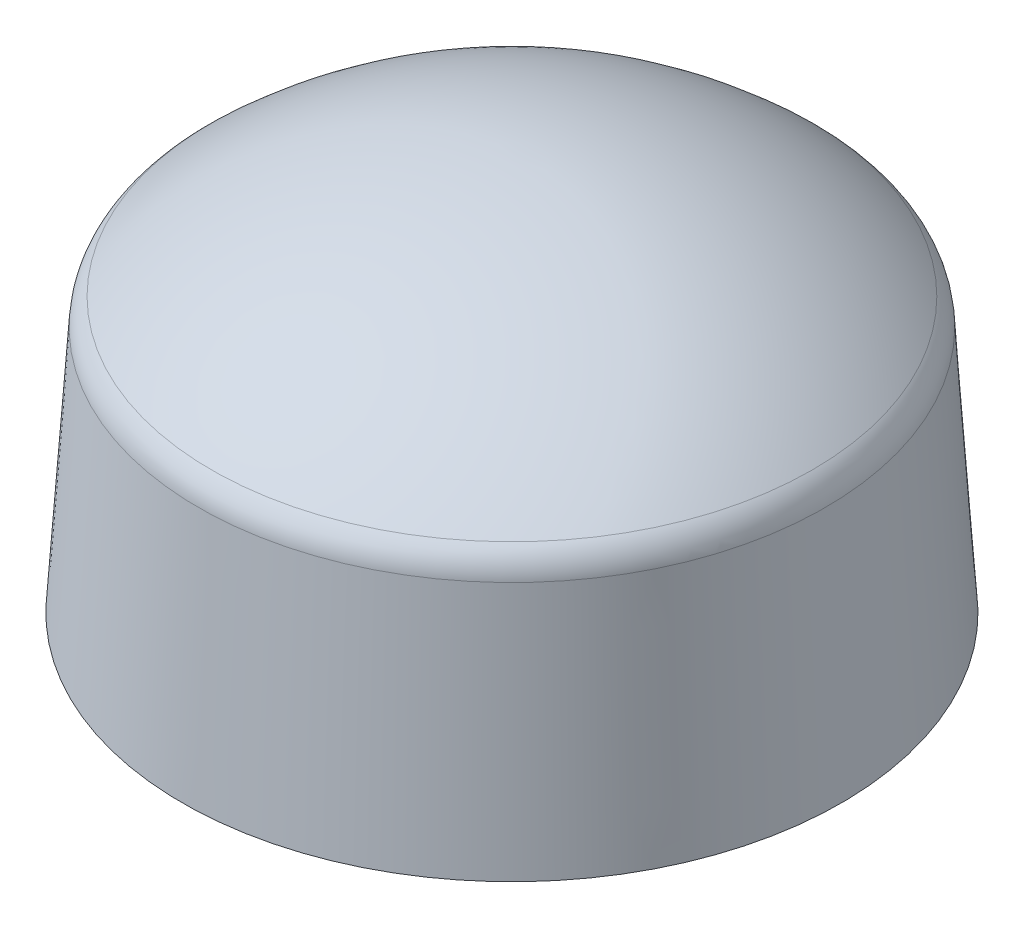
ISO-10303-21;
HEADER;
FILE_DESCRIPTION(('STEP AP214'),'2;1');
FILE_NAME('part.step','',(''),(''),'','','');
FILE_SCHEMA(('AUTOMOTIVE_DESIGN { 1 0 10303 214 1 1 1 1 }'));
ENDSEC;
DATA;
#1=APPLICATION_CONTEXT('core data for automotive mechanical design processes');
#2=APPLICATION_PROTOCOL_DEFINITION('international standard','automotive_design',2000,#1);
#3=PRODUCT_CONTEXT('',#1,'mechanical');
#4=PRODUCT('Part','Part','',(#3));
#5=PRODUCT_RELATED_PRODUCT_CATEGORY('part','',(#4));
#6=PRODUCT_DEFINITION_FORMATION('','',#4);
#7=PRODUCT_DEFINITION_CONTEXT('part definition',#1,'design');
#8=PRODUCT_DEFINITION('design','',#6,#7);
#9=PRODUCT_DEFINITION_SHAPE('','',#8);
#10=(LENGTH_UNIT() NAMED_UNIT(*) SI_UNIT(.MILLI.,.METRE.));
#11=(NAMED_UNIT(*) PLANE_ANGLE_UNIT() SI_UNIT($,.RADIAN.));
#12=(NAMED_UNIT(*) SI_UNIT($,.STERADIAN.) SOLID_ANGLE_UNIT());
#13=UNCERTAINTY_MEASURE_WITH_UNIT(LENGTH_MEASURE(1.E-05),#10,'distance_accuracy_value','');
#14=(GEOMETRIC_REPRESENTATION_CONTEXT(3) GLOBAL_UNCERTAINTY_ASSIGNED_CONTEXT((#13)) GLOBAL_UNIT_ASSIGNED_CONTEXT((#10,
#11,#12)) REPRESENTATION_CONTEXT('',''));
#15=CARTESIAN_POINT('',(0.,0.,0.));
#16=DIRECTION('',(0.,0.,1.));
#17=DIRECTION('',(1.,0.,0.));
#18=AXIS2_PLACEMENT_3D('',#15,#16,#17);
#19=CARTESIAN_POINT('',(0.,-11.3761475628999,0.));
#20=DIRECTION('',(0.,-1.,0.));
#21=DIRECTION('',(1.,0.,0.));
#22=AXIS2_PLACEMENT_3D('',#19,#20,#21);
#23=SPHERICAL_SURFACE('',#22,11.3761475628999);
#24=CARTESIAN_POINT('',(0.,-2.97183098168909,0.));
#25=DIRECTION('',(0.,-1.,0.));
#26=DIRECTION('',(0.,0.,-1.));
#27=AXIS2_PLACEMENT_3D('',#24,#25,#26);
#28=CIRCLE('',#27,7.66708524640611);
#29=CARTESIAN_POINT('',(0.,-2.97183098168909,-7.66708524640611));
#30=VERTEX_POINT('',#29);
#31=EDGE_CURVE('E10',#30,#30,#28,.T.);
#32=ORIENTED_EDGE('',*,*,#31,.F.);
#33=EDGE_LOOP('',(#32));
#34=FACE_BOUND('',#33,.T.);
#35=ADVANCED_FACE('F39',(#34),#23,.T.);
#36=CARTESIAN_POINT('',(0.,-3.71059746961854,0.));
#37=DIRECTION('',(0.,-1.,0.));
#38=DIRECTION('',(0.,0.,-1.));
#39=AXIS2_PLACEMENT_3D('',#36,#37,#38);
#40=TOROIDAL_SURFACE('',#39,6.99312376656295,0.999999999999999);
#41=CARTESIAN_POINT('',(0.,-3.64438837524142,0.));
#42=DIRECTION('',(0.,-1.,0.));
#43=DIRECTION('',(0.,0.,-1.));
#44=AXIS2_PLACEMENT_3D('',#41,#42,#43);
#45=CIRCLE('',#44,7.99092953715248);
#46=CARTESIAN_POINT('',(0.,-3.64438837524142,-7.99092953715248));
#47=VERTEX_POINT('',#46);
#48=EDGE_CURVE('E46',#47,#47,#45,.T.);
#49=ORIENTED_EDGE('',*,*,#48,.F.);
#50=EDGE_LOOP('',(#49));
#51=FACE_BOUND('',#50,.T.);
#52=ORIENTED_EDGE('',*,*,#31,.T.);
#53=EDGE_LOOP('',(#52));
#54=FACE_BOUND('',#53,.T.);
#55=ADVANCED_FACE('F113',(#51,#54),#40,.T.);
#56=CARTESIAN_POINT('',(0.,-3.64438837524142,0.));
#57=DIRECTION('',(0.,-1.,0.));
#58=DIRECTION('',(0.,0.,-1.));
#59=AXIS2_PLACEMENT_3D('',#56,#57,#58);
#60=CONICAL_SURFACE('',#59,7.99092953715248,0.0662575629009215);
#61=CARTESIAN_POINT('',(0.,-9.96,0.));
#62=DIRECTION('',(0.,-1.,0.));
#63=DIRECTION('',(0.,0.,-1.));
#64=AXIS2_PLACEMENT_3D('',#61,#62,#63);
#65=CIRCLE('',#64,8.41);
#66=CARTESIAN_POINT('',(0.,-9.96,-8.41));
#67=VERTEX_POINT('',#66);
#68=EDGE_CURVE('E51',#67,#67,#65,.T.);
#69=ORIENTED_EDGE('',*,*,#68,.F.);
#70=EDGE_LOOP('',(#69));
#71=FACE_BOUND('',#70,.T.);
#72=ORIENTED_EDGE('',*,*,#48,.T.);
#73=EDGE_LOOP('',(#72));
#74=FACE_BOUND('',#73,.T.);
#75=ADVANCED_FACE('F108',(#71,#74),#60,.T.);
#76=CARTESIAN_POINT('',(-6.89,-9.96,0.));
#77=DIRECTION('',(0.,1.,0.));
#78=DIRECTION('',(0.,0.,1.));
#79=AXIS2_PLACEMENT_3D('',#76,#77,#78);
#80=PLANE('',#79);
#81=CARTESIAN_POINT('',(0.,-9.96,0.));
#82=DIRECTION('',(0.,-1.,0.));
#83=DIRECTION('',(0.,0.,-1.));
#84=AXIS2_PLACEMENT_3D('',#81,#82,#83);
#85=CIRCLE('',#84,6.79);
#86=CARTESIAN_POINT('',(0.,-9.96,-6.79));
#87=VERTEX_POINT('',#86);
#88=EDGE_CURVE('E56',#87,#87,#85,.T.);
#89=ORIENTED_EDGE('',*,*,#88,.F.);
#90=EDGE_LOOP('',(#89));
#91=FACE_BOUND('',#90,.T.);
#92=ORIENTED_EDGE('',*,*,#68,.T.);
#93=EDGE_LOOP('',(#92));
#94=FACE_BOUND('',#93,.T.);
#95=ADVANCED_FACE('F102',(#91,#94),#80,.F.);
#96=CARTESIAN_POINT('',(0.,0.,0.));
#97=DIRECTION('',(0.,-1.,0.));
#98=DIRECTION('',(0.,0.,-1.));
#99=AXIS2_PLACEMENT_3D('',#96,#97,#98);
#100=CYLINDRICAL_SURFACE('',#99,6.79);
#101=CARTESIAN_POINT('',(0.,-9.46,0.));
#102=DIRECTION('',(0.,-1.,0.));
#103=DIRECTION('',(0.,0.,-1.));
#104=AXIS2_PLACEMENT_3D('',#101,#102,#103);
#105=CIRCLE('',#104,6.79);
#106=CARTESIAN_POINT('',(0.,-9.46,-6.79));
#107=VERTEX_POINT('',#106);
#108=EDGE_CURVE('E62',#107,#107,#105,.T.);
#109=ORIENTED_EDGE('',*,*,#108,.F.);
#110=EDGE_LOOP('',(#109));
#111=FACE_BOUND('',#110,.T.);
#112=ORIENTED_EDGE('',*,*,#88,.T.);
#113=EDGE_LOOP('',(#112));
#114=FACE_BOUND('',#113,.T.);
#115=ADVANCED_FACE('F96',(#111,#114),#100,.F.);
#116=CARTESIAN_POINT('',(-6.79,-9.46,0.));
#117=DIRECTION('',(0.,-1.,0.));
#118=DIRECTION('',(0.,0.,-1.));
#119=AXIS2_PLACEMENT_3D('',#116,#117,#118);
#120=PLANE('',#119);
#121=CARTESIAN_POINT('',(0.,-9.46,0.));
#122=DIRECTION('',(0.,-1.,0.));
#123=DIRECTION('',(0.,0.,-1.));
#124=AXIS2_PLACEMENT_3D('',#121,#122,#123);
#125=CIRCLE('',#124,7.29);
#126=CARTESIAN_POINT('',(0.,-9.46,-7.29));
#127=VERTEX_POINT('',#126);
#128=EDGE_CURVE('E66',#127,#127,#125,.T.);
#129=ORIENTED_EDGE('',*,*,#128,.F.);
#130=EDGE_LOOP('',(#129));
#131=FACE_BOUND('',#130,.T.);
#132=ORIENTED_EDGE('',*,*,#108,.T.);
#133=EDGE_LOOP('',(#132));
#134=FACE_BOUND('',#133,.T.);
#135=ADVANCED_FACE('F90',(#131,#134),#120,.F.);
#136=CARTESIAN_POINT('',(0.,-9.46,0.));
#137=DIRECTION('',(0.,-1.,0.));
#138=DIRECTION('',(0.,0.,-1.));
#139=AXIS2_PLACEMENT_3D('',#136,#137,#138);
#140=CONICAL_SURFACE('',#139,7.29,0.0662575629009213);
#141=CARTESIAN_POINT('',(0.,-4.09557410555816,0.));
#142=DIRECTION('',(0.,-1.,0.));
#143=DIRECTION('',(0.,0.,-1.));
#144=AXIS2_PLACEMENT_3D('',#141,#142,#143);
#145=CIRCLE('',#144,6.9340451731259);
#146=CARTESIAN_POINT('',(0.,-4.09557410555816,-6.9340451731259));
#147=VERTEX_POINT('',#146);
#148=EDGE_CURVE('E70',#147,#147,#145,.T.);
#149=ORIENTED_EDGE('',*,*,#148,.F.);
#150=EDGE_LOOP('',(#149));
#151=FACE_BOUND('',#150,.T.);
#152=ORIENTED_EDGE('',*,*,#128,.T.);
#153=EDGE_LOOP('',(#152));
#154=FACE_BOUND('',#153,.T.);
#155=ADVANCED_FACE('F84',(#151,#154),#140,.F.);
#156=CARTESIAN_POINT('',(0.,-4.10594616508961,0.));
#157=DIRECTION('',(0.,-1.,0.));
#158=DIRECTION('',(0.,0.,-1.));
#159=AXIS2_PLACEMENT_3D('',#156,#157,#158);
#160=TOROIDAL_SURFACE('',#159,6.77773279714881,0.156656115432905);
#161=CARTESIAN_POINT('',(0.,-3.99136067392888,0.));
#162=DIRECTION('',(0.,-1.,0.));
#163=DIRECTION('',(0.,0.,-1.));
#164=AXIS2_PLACEMENT_3D('',#161,#162,#163);
#165=CIRCLE('',#164,6.88455650106317);
#166=CARTESIAN_POINT('',(0.,-3.99136067392888,-6.88455650106317));
#167=VERTEX_POINT('',#166);
#168=EDGE_CURVE('E74',#167,#167,#165,.T.);
#169=ORIENTED_EDGE('',*,*,#168,.F.);
#170=EDGE_LOOP('',(#169));
#171=FACE_BOUND('',#170,.T.);
#172=ORIENTED_EDGE('',*,*,#148,.T.);
#173=EDGE_LOOP('',(#172));
#174=FACE_BOUND('',#173,.T.);
#175=ADVANCED_FACE('F81',(#171,#174),#160,.F.);
#176=CARTESIAN_POINT('',(0.,-11.3761475628999,0.));
#177=DIRECTION('',(0.,-1.,0.));
#178=DIRECTION('',(-1.,0.,0.));
#179=AXIS2_PLACEMENT_3D('',#176,#177,#178);
#180=SPHERICAL_SURFACE('',#179,10.0961475628999);
#181=ORIENTED_EDGE('',*,*,#168,.T.);
#182=EDGE_LOOP('',(#181));
#183=FACE_BOUND('',#182,.T.);
#184=ADVANCED_FACE('F79',(#183),#180,.F.);
#185=CLOSED_SHELL('',(#35,#55,#75,#95,#115,#135,#155,#175,#184));
#186=MANIFOLD_SOLID_BREP('B2',#185);
#187=ADVANCED_BREP_SHAPE_REPRESENTATION('',(#18,#186),#14);
#188=SHAPE_DEFINITION_REPRESENTATION(#9,#187);
ENDSEC;
END-ISO-10303-21;
